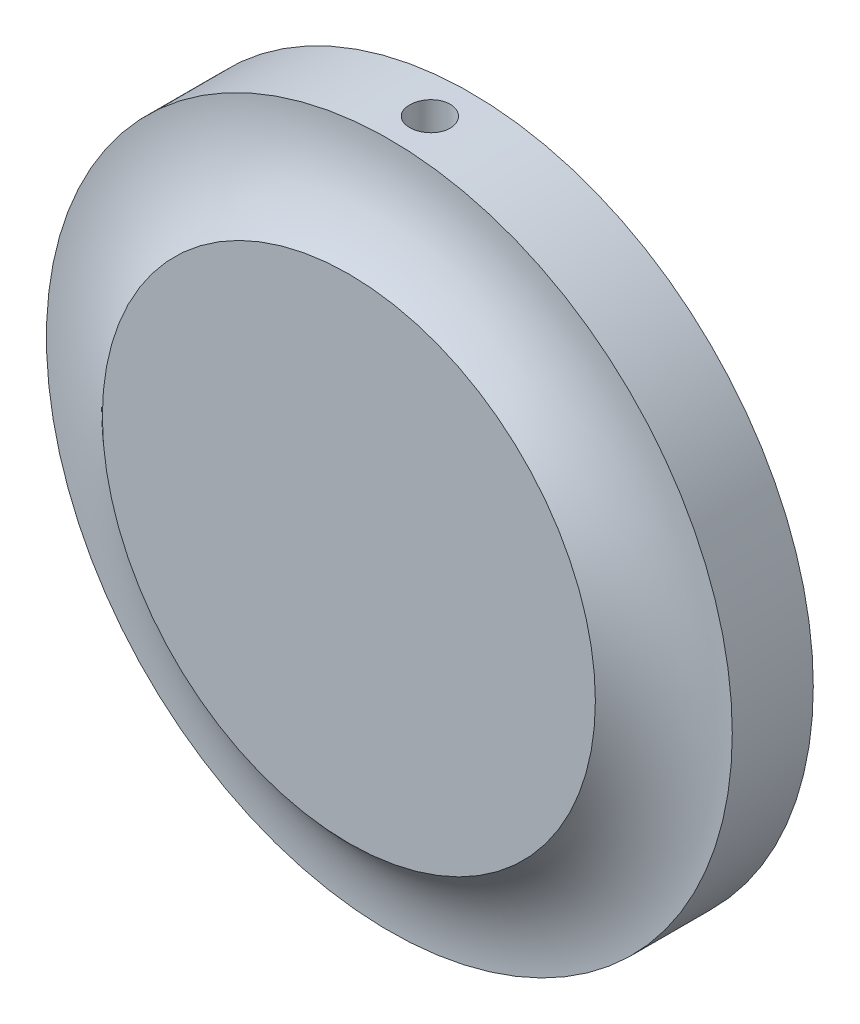
ISO-10303-21;
HEADER;
FILE_DESCRIPTION(('STEP AP214'),'2;1');
FILE_NAME('part.step','',(''),(''),'','','');
FILE_SCHEMA(('AUTOMOTIVE_DESIGN { 1 0 10303 214 1 1 1 1 }'));
ENDSEC;
DATA;
#1=APPLICATION_CONTEXT('core data for automotive mechanical design processes');
#2=APPLICATION_PROTOCOL_DEFINITION('international standard','automotive_design',2000,#1);
#3=PRODUCT_CONTEXT('',#1,'mechanical');
#4=PRODUCT('Part','Part','',(#3));
#5=PRODUCT_RELATED_PRODUCT_CATEGORY('part','',(#4));
#6=PRODUCT_DEFINITION_FORMATION('','',#4);
#7=PRODUCT_DEFINITION_CONTEXT('part definition',#1,'design');
#8=PRODUCT_DEFINITION('design','',#6,#7);
#9=PRODUCT_DEFINITION_SHAPE('','',#8);
#10=(LENGTH_UNIT() NAMED_UNIT(*) SI_UNIT(.MILLI.,.METRE.));
#11=(NAMED_UNIT(*) PLANE_ANGLE_UNIT() SI_UNIT($,.RADIAN.));
#12=(NAMED_UNIT(*) SI_UNIT($,.STERADIAN.) SOLID_ANGLE_UNIT());
#13=UNCERTAINTY_MEASURE_WITH_UNIT(LENGTH_MEASURE(1.E-05),#10,'distance_accuracy_value','');
#14=(GEOMETRIC_REPRESENTATION_CONTEXT(3) GLOBAL_UNCERTAINTY_ASSIGNED_CONTEXT((#13)) GLOBAL_UNIT_ASSIGNED_CONTEXT((#10,
#11,#12)) REPRESENTATION_CONTEXT('',''));
#15=CARTESIAN_POINT('',(0.,0.,0.));
#16=DIRECTION('',(0.,0.,1.));
#17=DIRECTION('',(1.,0.,0.));
#18=AXIS2_PLACEMENT_3D('',#15,#16,#17);
#19=CARTESIAN_POINT('',(0.,0.,6.));
#20=DIRECTION('',(0.,0.,-1.));
#21=DIRECTION('',(-1.,0.,0.));
#22=AXIS2_PLACEMENT_3D('',#19,#20,#21);
#23=CYLINDRICAL_SURFACE('',#22,25.4);
#24=CARTESIAN_POINT('',(0.,0.,3.));
#25=DIRECTION('',(0.,0.,1.));
#26=DIRECTION('',(1.,0.,0.));
#27=AXIS2_PLACEMENT_3D('',#24,#25,#26);
#28=CIRCLE('',#27,25.4);
#29=CARTESIAN_POINT('',(25.4,0.,3.));
#30=VERTEX_POINT('',#29);
#31=EDGE_CURVE('E58',#30,#30,#28,.T.);
#32=ORIENTED_EDGE('',*,*,#31,.F.);
#33=EDGE_LOOP('',(#32));
#34=FACE_BOUND('',#33,.T.);
#35=CARTESIAN_POINT('',(0.,0.,-3.));
#36=DIRECTION('',(0.,0.,1.));
#37=DIRECTION('',(1.,0.,0.));
#38=AXIS2_PLACEMENT_3D('',#35,#36,#37);
#39=CIRCLE('',#38,25.4);
#40=CARTESIAN_POINT('',(25.4,0.,-3.));
#41=VERTEX_POINT('',#40);
#42=EDGE_CURVE('E71',#41,#41,#39,.T.);
#43=ORIENTED_EDGE('',*,*,#42,.T.);
#44=EDGE_LOOP('',(#43));
#45=FACE_BOUND('',#44,.T.);
#46=CARTESIAN_POINT('',(0.,25.4,-1.5));
#47=CARTESIAN_POINT('',(-0.0841769466667568,25.3999994100699,-1.49999629279415));
#48=CARTESIAN_POINT('',(-0.168413058569813,25.3995770726727,-1.49289043497013));
#49=CARTESIAN_POINT('',(-0.334559979664901,25.3979328876604,-1.46464538901151));
#50=CARTESIAN_POINT('',(-0.416467955799686,25.3967101061011,-1.44348980748832));
#51=CARTESIAN_POINT('',(-0.575527865496391,25.3936033827056,-1.38775449416672));
#52=CARTESIAN_POINT('',(-0.652682258273793,25.3917197861694,-1.35318177231453));
#53=CARTESIAN_POINT('',(-0.800072247583642,25.3875033699821,-1.27160476100779));
#54=CARTESIAN_POINT('',(-0.870309437994564,25.385170654186,-1.22460334464455));
#55=CARTESIAN_POINT('',(-1.00198664319296,25.3803147410022,-1.11943321510851));
#56=CARTESIAN_POINT('',(-1.06341608579661,25.3777913201605,-1.06125127437712));
#57=CARTESIAN_POINT('',(-1.17564370438855,25.372840313989,-0.935398734011918));
#58=CARTESIAN_POINT('',(-1.22644143913635,25.3704127326402,-0.867727740755039));
#59=CARTESIAN_POINT('',(-1.3159954683686,25.3659254736543,-0.724759174354697));
#60=CARTESIAN_POINT('',(-1.354743101614,25.3638660610956,-0.64945616686486));
#61=CARTESIAN_POINT('',(-1.41904157182243,25.3603502324431,-0.493399285680227));
#62=CARTESIAN_POINT('',(-1.44459253824137,25.3588938104343,-0.41264546546529));
#63=CARTESIAN_POINT('',(-1.48174335713464,25.3567503067331,-0.248080073113146));
#64=CARTESIAN_POINT('',(-1.49335960273108,25.3560623211006,-0.164272213704508));
#65=CARTESIAN_POINT('',(-1.50236183560243,25.3555305652992,0.00410647482268728));
#66=CARTESIAN_POINT('',(-1.49974796948265,25.3556867864328,0.0886772960718916));
#67=CARTESIAN_POINT('',(-1.48037779381195,25.3568249876892,0.256069634024783));
#68=CARTESIAN_POINT('',(-1.46363921523518,25.3578059325176,0.33889321052427));
#69=CARTESIAN_POINT('',(-1.41652225642481,25.3604813996397,0.5005529742705));
#70=CARTESIAN_POINT('',(-1.38614380162101,25.3621759258346,0.579389139715155));
#71=CARTESIAN_POINT('',(-1.3125892581056,25.3660887780197,0.730893224978648));
#72=CARTESIAN_POINT('',(-1.26940511405383,25.368307433531,0.803557225111591));
#73=CARTESIAN_POINT('',(-1.171470877089,25.3730181739311,0.940611458205936));
#74=CARTESIAN_POINT('',(-1.11672066855076,25.3755102615532,1.00500160844385));
#75=CARTESIAN_POINT('',(-0.997108538388201,25.3804916107965,1.12378351462966));
#76=CARTESIAN_POINT('',(-0.932231268980543,25.382980862255,1.17815981714926));
#77=CARTESIAN_POINT('',(-0.794260488548905,25.3876723363657,1.27525132067149));
#78=CARTESIAN_POINT('',(-0.721166974931279,25.3898745589274,1.31796651799302));
#79=CARTESIAN_POINT('',(-0.568829288398729,25.393743957677,1.39052192403508));
#80=CARTESIAN_POINT('',(-0.489584842604515,25.3954111101101,1.42036156116003));
#81=CARTESIAN_POINT('',(-0.327198884234703,25.3980221696407,1.46630855223605));
#82=CARTESIAN_POINT('',(-0.244057412314082,25.3989660842815,1.48241604941141));
#83=CARTESIAN_POINT('',(-0.0763715847400667,25.400023327702,1.5004224098172));
#84=CARTESIAN_POINT('',(0.00817046880303702,25.4001379056036,1.50234264156562));
#85=CARTESIAN_POINT('',(0.176375512004177,25.3995268844421,1.49197577519776));
#86=CARTESIAN_POINT('',(0.260038505737821,25.398801289276,1.47968874298032));
#87=CARTESIAN_POINT('',(0.424050442431469,25.3965924222477,1.44127382342948));
#88=CARTESIAN_POINT('',(0.504401686205874,25.3951096863304,1.41515572598498));
#89=CARTESIAN_POINT('',(0.659580219839154,25.391553387001,1.34983001039815));
#90=CARTESIAN_POINT('',(0.734407465304041,25.3894798188413,1.31062228707413));
#91=CARTESIAN_POINT('',(0.87651186401801,25.3849718171922,1.22017579347174));
#92=CARTESIAN_POINT('',(0.94377991001302,25.3825369564412,1.16892273600239));
#93=CARTESIAN_POINT('',(1.06876476899049,25.3775818763563,1.05586127936106));
#94=CARTESIAN_POINT('',(1.12648149771494,25.3750616562696,0.99405278708292));
#95=CARTESIAN_POINT('',(1.23079760947571,25.3702163037102,0.861542864288868));
#96=CARTESIAN_POINT('',(1.27738314072801,25.3678914166194,0.790830519006366));
#97=CARTESIAN_POINT('',(1.3580197393421,25.363702799095,0.64257509690259));
#98=CARTESIAN_POINT('',(1.3920708772648,25.3618390660652,0.56503205853695));
#99=CARTESIAN_POINT('',(1.44664806595254,25.3587846954266,0.405367222421356));
#100=CARTESIAN_POINT('',(1.4671828683512,25.357593622351,0.323248424849632));
#101=CARTESIAN_POINT('',(1.49417307278162,25.3560176768022,0.156721355365735));
#102=CARTESIAN_POINT('',(1.50062859669967,25.3556327973495,0.0723131032800975));
#103=CARTESIAN_POINT('',(1.49927583631176,25.355712810844,-0.0962590655060003));
#104=CARTESIAN_POINT('',(1.4914893325967,25.356176406204,-0.180423158475353));
#105=CARTESIAN_POINT('',(1.46191866549162,25.357898377889,-0.34624675411511));
#106=CARTESIAN_POINT('',(1.44013447631187,25.3591567556785,-0.427906252170686));
#107=CARTESIAN_POINT('',(1.3831915960879,25.3623261671318,-0.586406268163739));
#108=CARTESIAN_POINT('',(1.34803293502243,25.3642371993326,-0.66324679690244));
#109=CARTESIAN_POINT('',(1.26534230499456,25.3684965124139,-0.809936781227264));
#110=CARTESIAN_POINT('',(1.21781067409879,25.3708447813472,-0.879786427753066));
#111=CARTESIAN_POINT('',(1.11164336868006,25.3757180958148,-1.01062196138025));
#112=CARTESIAN_POINT('',(1.05299207119309,25.378243386878,-1.07159516152424));
#113=CARTESIAN_POINT('',(0.926269000579527,25.383184150236,-1.18285058181256));
#114=CARTESIAN_POINT('',(0.85819492238178,25.3855995954669,-1.2331301783503));
#115=CARTESIAN_POINT('',(0.714488372953173,25.3900507425787,-1.32160410705754));
#116=CARTESIAN_POINT('',(0.638847273865358,25.3920860032209,-1.35978443225902));
#117=CARTESIAN_POINT('',(0.482271785997641,25.3955413494597,-1.42285677377442));
#118=CARTESIAN_POINT('',(0.401343738413631,25.3969621569902,-1.44776439250621));
#119=CARTESIAN_POINT('',(0.266598556420354,25.3986551408711,-1.47709283058096));
#120=CARTESIAN_POINT('',(0.213652949737586,25.3991572291652,-1.48567195330904));
#121=CARTESIAN_POINT('',(0.107146220047341,25.3998298462951,-1.49712671449698));
#122=CARTESIAN_POINT('',(0.0535850977915683,25.4000003755359,-1.50000235992152));
#123=CARTESIAN_POINT('',(0.,25.4,-1.5));
#124=B_SPLINE_CURVE_WITH_KNOTS('',3,(#46,#47,#48,#49,#50,#51,#52,#53,#54,#55,#56,#57,#58,#59,
#60,#61,#62,#63,#64,#65,#66,#67,#68,#69,#70,#71,#72,#73,#74,#75,#76,#77,#78,#79,#80,#81,#82,#83,
#84,#85,#86,#87,#88,#89,#90,#91,#92,#93,#94,#95,#96,#97,#98,#99,#100,#101,#102,#103,#104,#105,
#106,#107,#108,#109,#110,#111,#112,#113,#114,#115,#116,#117,#118,#119,#120,#121,#122,#123),
.UNSPECIFIED.,.T.,.F.,(4,2,2,2,2,2,2,2,2,2,2,2,2,2,2,2,2,2,2,2,2,2,2,2,2,2,2,2,2,2,2,2,2,2,2,2,
2,2,4),(0.,0.252335226122401,0.504965398568471,0.757463758652311,1.00990380065459,
1.26264436125593,1.51539540909646,1.76832770889448,2.02125752744446,2.27388950088549,
2.52651887159805,2.77883158363871,3.03114567510815,3.28361882111495,3.53609449119881,
3.78895657669241,4.04181874200797,4.294692131692,4.5475628839099,4.80005269048983,
5.05254132592786,5.30485148355363,5.55716366866647,5.80977664989043,6.06239185944893,
6.31531980777752,6.56824633225597,6.82100892891396,7.07376933736173,7.32614351789391,
7.57851816340872,7.83089224323151,8.08325942816145,8.33598384865513,8.5887702021092,
8.84184813872666,9.09462791555249,9.25525888180709,9.4158896519104),.UNSPECIFIED.);
#125=CARTESIAN_POINT('',(0.,25.4,-1.5));
#126=VERTEX_POINT('',#125);
#127=EDGE_CURVE('E12',#126,#126,#124,.T.);
#128=ORIENTED_EDGE('',*,*,#127,.F.);
#129=EDGE_LOOP('',(#128));
#130=FACE_BOUND('',#129,.T.);
#131=ADVANCED_FACE('F46',(#34,#45,#130),#23,.T.);
#132=CARTESIAN_POINT('',(0.,0.,13.));
#133=DIRECTION('',(0.,0.,1.));
#134=DIRECTION('',(1.,0.,0.));
#135=AXIS2_PLACEMENT_3D('',#132,#133,#134);
#136=TOROIDAL_SURFACE('',#135,25.4,10.);
#137=CARTESIAN_POINT('',(0.,0.,6.));
#138=DIRECTION('',(0.,0.,-1.));
#139=DIRECTION('',(-1.,0.,0.));
#140=AXIS2_PLACEMENT_3D('',#137,#138,#139);
#141=CIRCLE('',#140,18.2585715714571);
#142=CARTESIAN_POINT('',(-18.2585715714571,0.,6.));
#143=VERTEX_POINT('',#142);
#144=EDGE_CURVE('E64',#143,#143,#141,.F.);
#145=ORIENTED_EDGE('',*,*,#144,.F.);
#146=EDGE_LOOP('',(#145));
#147=FACE_BOUND('',#146,.T.);
#148=ORIENTED_EDGE('',*,*,#31,.T.);
#149=EDGE_LOOP('',(#148));
#150=FACE_BOUND('',#149,.T.);
#151=ADVANCED_FACE('F99',(#147,#150),#136,.F.);
#152=CARTESIAN_POINT('',(0.,0.,6.));
#153=DIRECTION('',(0.,0.,1.));
#154=DIRECTION('',(1.,0.,0.));
#155=AXIS2_PLACEMENT_3D('',#152,#153,#154);
#156=PLANE('',#155);
#157=ORIENTED_EDGE('',*,*,#144,.T.);
#158=EDGE_LOOP('',(#157));
#159=FACE_BOUND('',#158,.T.);
#160=ADVANCED_FACE('F104',(#159),#156,.T.);
#161=CARTESIAN_POINT('',(0.,0.,-13.));
#162=DIRECTION('',(0.,0.,-1.));
#163=DIRECTION('',(1.,0.,0.));
#164=AXIS2_PLACEMENT_3D('',#161,#162,#163);
#165=TOROIDAL_SURFACE('',#164,25.4,10.);
#166=CARTESIAN_POINT('',(0.,0.,-6.));
#167=DIRECTION('',(0.,0.,-1.));
#168=DIRECTION('',(-1.,0.,0.));
#169=AXIS2_PLACEMENT_3D('',#166,#167,#168);
#170=CIRCLE('',#169,18.2585715714571);
#171=CARTESIAN_POINT('',(-18.2585715714571,0.,-6.));
#172=VERTEX_POINT('',#171);
#173=EDGE_CURVE('E73',#172,#172,#170,.F.);
#174=ORIENTED_EDGE('',*,*,#173,.T.);
#175=EDGE_LOOP('',(#174));
#176=FACE_BOUND('',#175,.T.);
#177=ORIENTED_EDGE('',*,*,#42,.F.);
#178=EDGE_LOOP('',(#177));
#179=FACE_BOUND('',#178,.T.);
#180=ADVANCED_FACE('F93',(#176,#179),#165,.F.);
#181=CARTESIAN_POINT('',(0.,0.,-6.));
#182=DIRECTION('',(0.,0.,-1.));
#183=DIRECTION('',(1.,0.,0.));
#184=AXIS2_PLACEMENT_3D('',#181,#182,#183);
#185=PLANE('',#184);
#186=ORIENTED_EDGE('',*,*,#173,.F.);
#187=EDGE_LOOP('',(#186));
#188=FACE_BOUND('',#187,.T.);
#189=ADVANCED_FACE('F87',(#188),#185,.T.);
#190=CARTESIAN_POINT('',(0.,25.4,0.));
#191=DIRECTION('',(0.,-1.,0.));
#192=DIRECTION('',(0.,0.,-1.));
#193=AXIS2_PLACEMENT_3D('',#190,#191,#192);
#194=CYLINDRICAL_SURFACE('',#193,1.5);
#195=CARTESIAN_POINT('',(0.,15.,0.));
#196=DIRECTION('',(0.,1.,0.));
#197=DIRECTION('',(0.,0.,1.));
#198=AXIS2_PLACEMENT_3D('',#195,#196,#197);
#199=CIRCLE('',#198,1.5);
#200=CARTESIAN_POINT('',(0.,15.,1.5));
#201=VERTEX_POINT('',#200);
#202=EDGE_CURVE('E76',#201,#201,#199,.T.);
#203=ORIENTED_EDGE('',*,*,#202,.F.);
#204=EDGE_LOOP('',(#203));
#205=FACE_BOUND('',#204,.T.);
#206=ORIENTED_EDGE('',*,*,#127,.T.);
#207=EDGE_LOOP('',(#206));
#208=FACE_BOUND('',#207,.T.);
#209=ADVANCED_FACE('F85',(#205,#208),#194,.F.);
#210=CARTESIAN_POINT('',(0.,15.,0.));
#211=DIRECTION('',(0.,1.,0.));
#212=DIRECTION('',(0.,0.,1.));
#213=AXIS2_PLACEMENT_3D('',#210,#211,#212);
#214=PLANE('',#213);
#215=ORIENTED_EDGE('',*,*,#202,.T.);
#216=EDGE_LOOP('',(#215));
#217=FACE_BOUND('',#216,.T.);
#218=ADVANCED_FACE('F83',(#217),#214,.T.);
#219=CLOSED_SHELL('',(#131,#151,#160,#180,#189,#209,#218));
#220=MANIFOLD_SOLID_BREP('B2',#219);
#221=ADVANCED_BREP_SHAPE_REPRESENTATION('',(#18,#220),#14);
#222=SHAPE_DEFINITION_REPRESENTATION(#9,#221);
ENDSEC;
END-ISO-10303-21;
